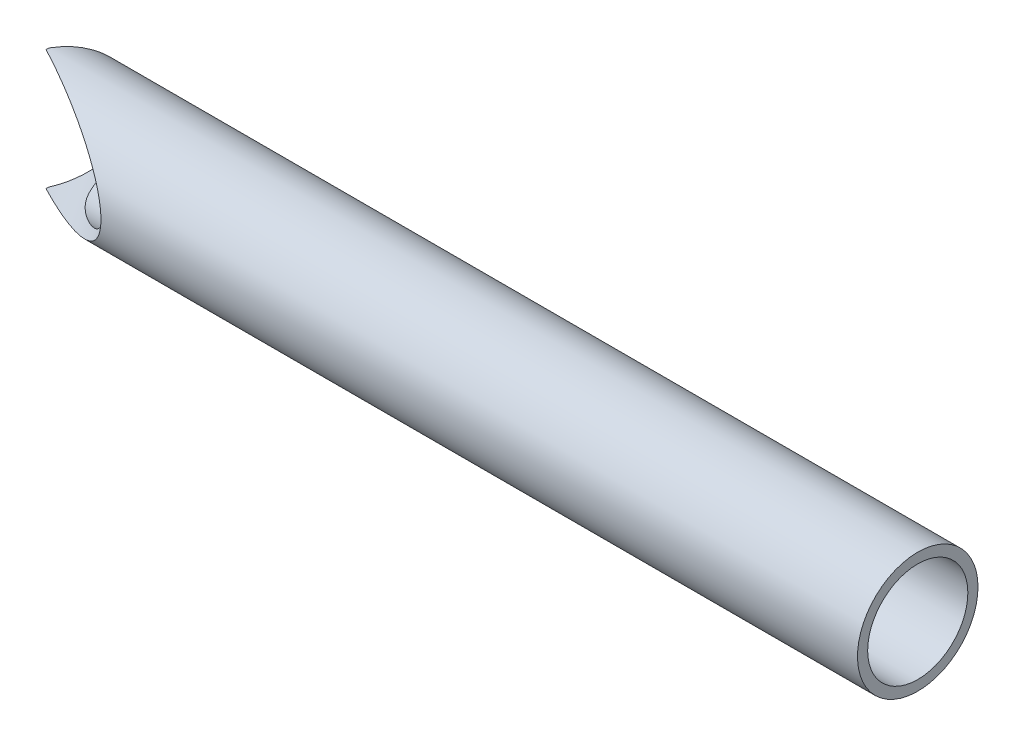
ISO-10303-21;
HEADER;
FILE_DESCRIPTION(('STEP AP214'),'2;1');
FILE_NAME('part.step','',(''),(''),'','','');
FILE_SCHEMA(('AUTOMOTIVE_DESIGN { 1 0 10303 214 1 1 1 1 }'));
ENDSEC;
DATA;
#1=APPLICATION_CONTEXT('core data for automotive mechanical design processes');
#2=APPLICATION_PROTOCOL_DEFINITION('international standard','automotive_design',2000,#1);
#3=PRODUCT_CONTEXT('',#1,'mechanical');
#4=PRODUCT('Part','Part','',(#3));
#5=PRODUCT_RELATED_PRODUCT_CATEGORY('part','',(#4));
#6=PRODUCT_DEFINITION_FORMATION('','',#4);
#7=PRODUCT_DEFINITION_CONTEXT('part definition',#1,'design');
#8=PRODUCT_DEFINITION('design','',#6,#7);
#9=PRODUCT_DEFINITION_SHAPE('','',#8);
#10=(LENGTH_UNIT() NAMED_UNIT(*) SI_UNIT(.MILLI.,.METRE.));
#11=(NAMED_UNIT(*) PLANE_ANGLE_UNIT() SI_UNIT($,.RADIAN.));
#12=(NAMED_UNIT(*) SI_UNIT($,.STERADIAN.) SOLID_ANGLE_UNIT());
#13=UNCERTAINTY_MEASURE_WITH_UNIT(LENGTH_MEASURE(1.E-05),#10,'distance_accuracy_value','');
#14=(GEOMETRIC_REPRESENTATION_CONTEXT(3) GLOBAL_UNCERTAINTY_ASSIGNED_CONTEXT((#13)) GLOBAL_UNIT_ASSIGNED_CONTEXT((#10,
#11,#12)) REPRESENTATION_CONTEXT('',''));
#15=CARTESIAN_POINT('',(0.,0.,0.));
#16=DIRECTION('',(0.,0.,1.));
#17=DIRECTION('',(1.,0.,0.));
#18=AXIS2_PLACEMENT_3D('',#15,#16,#17);
#19=CARTESIAN_POINT('',(304.8,0.,-1.11022302462516E-13));
#20=DIRECTION('',(1.,0.,0.));
#21=DIRECTION('',(0.,0.,-1.));
#22=AXIS2_PLACEMENT_3D('',#19,#20,#21);
#23=PLANE('',#22);
#24=CARTESIAN_POINT('',(304.8,0.,-1.11022302462516E-13));
#25=DIRECTION('',(1.,0.,0.));
#26=DIRECTION('',(0.,0.,-1.));
#27=AXIS2_PLACEMENT_3D('',#24,#25,#26);
#28=CIRCLE('',#27,21.082);
#29=CARTESIAN_POINT('',(304.8,0.,-21.0820000000001));
#30=VERTEX_POINT('',#29);
#31=EDGE_CURVE('E11',#30,#30,#28,.T.);
#32=ORIENTED_EDGE('',*,*,#31,.T.);
#33=EDGE_LOOP('',(#32));
#34=FACE_BOUND('',#33,.T.);
#35=CARTESIAN_POINT('',(304.8,0.,-1.11022302462516E-13));
#36=DIRECTION('',(1.,0.,0.));
#37=DIRECTION('',(0.,0.,-1.));
#38=AXIS2_PLACEMENT_3D('',#35,#36,#37);
#39=CIRCLE('',#38,17.526);
#40=CARTESIAN_POINT('',(304.8,0.,-17.5260000000001));
#41=VERTEX_POINT('',#40);
#42=EDGE_CURVE('E52',#41,#41,#39,.T.);
#43=ORIENTED_EDGE('',*,*,#42,.F.);
#44=EDGE_LOOP('',(#43));
#45=FACE_BOUND('',#44,.T.);
#46=ADVANCED_FACE('F40',(#34,#45),#23,.T.);
#47=CARTESIAN_POINT('',(304.8,0.,-1.11022302462516E-13));
#48=DIRECTION('',(-1.,0.,0.));
#49=DIRECTION('',(0.,0.,1.));
#50=AXIS2_PLACEMENT_3D('',#47,#48,#49);
#51=CYLINDRICAL_SURFACE('',#50,21.082);
#52=ORIENTED_EDGE('',*,*,#31,.F.);
#53=EDGE_LOOP('',(#52));
#54=FACE_BOUND('',#53,.T.);
#55=CARTESIAN_POINT('',(3.88578058618805E-13,0.,-1.11022302462516E-13));
#56=DIRECTION('',(1.,0.,0.));
#57=DIRECTION('',(0.,-0.999948117648207,0.0101863640131056));
#58=AXIS2_PLACEMENT_3D('',#55,#56,#57);
#59=CIRCLE('',#58,21.082);
#60=CARTESIAN_POINT('',(0.,-21.0809062162596,0.214748926124053));
#61=VERTEX_POINT('',#60);
#62=CARTESIAN_POINT('',(0.,-21.0671006615473,-0.792460545541385));
#63=VERTEX_POINT('',#62);
#64=EDGE_CURVE('E63',#61,#63,#59,.T.);
#65=ORIENTED_EDGE('',*,*,#64,.T.);
#66=CARTESIAN_POINT('',(-0.412528848871219,0.,-6.66133814775094E-13));
#67=DIRECTION('',(-0.887010833178221,0.,-0.461748613235035));
#68=DIRECTION('',(-0.461748613235035,0.,0.887010833178221));
#69=AXIS2_PLACEMENT_3D('',#66,#67,#68);
#70=ELLIPSE('',#69,23.7674662038362,21.082);
#71=CARTESIAN_POINT('',(0.,21.0671006615473,-0.792460545541385));
#72=VERTEX_POINT('',#71);
#73=EDGE_CURVE('E85',#63,#72,#70,.F.);
#74=ORIENTED_EDGE('',*,*,#73,.T.);
#75=CARTESIAN_POINT('',(3.88578058618805E-13,0.,-1.11022302462516E-13));
#76=DIRECTION('',(1.,0.,0.));
#77=DIRECTION('',(0.,0.999293267315585,-0.0375894386462891));
#78=AXIS2_PLACEMENT_3D('',#75,#76,#77);
#79=CIRCLE('',#78,21.082);
#80=CARTESIAN_POINT('',(0.,21.0809062162596,0.214748926124053));
#81=VERTEX_POINT('',#80);
#82=EDGE_CURVE('E71',#72,#81,#79,.T.);
#83=ORIENTED_EDGE('',*,*,#82,.T.);
#84=CARTESIAN_POINT('',(-0.412528848871219,0.,-6.66133814775094E-13));
#85=DIRECTION('',(-0.461748613235035,0.,0.887010833178221));
#86=DIRECTION('',(-0.887010833178221,0.,-0.461748613235035));
#87=AXIS2_PLACEMENT_3D('',#84,#85,#86);
#88=ELLIPSE('',#87,45.6568777809605,21.082);
#89=EDGE_CURVE('E79',#81,#61,#88,.F.);
#90=ORIENTED_EDGE('',*,*,#89,.T.);
#91=EDGE_LOOP('',(#65,#74,#83,#90));
#92=FACE_BOUND('',#91,.T.);
#93=ADVANCED_FACE('F42',(#54,#92),#51,.T.);
#94=CARTESIAN_POINT('',(304.8,0.,-1.11022302462516E-13));
#95=DIRECTION('',(-1.,0.,0.));
#96=DIRECTION('',(0.,0.,1.));
#97=AXIS2_PLACEMENT_3D('',#94,#95,#96);
#98=CYLINDRICAL_SURFACE('',#97,17.526);
#99=CARTESIAN_POINT('',(37.5956783460614,0.,17.5259999999997));
#100=CARTESIAN_POINT('',(37.5956757343342,-0.266591693921366,17.5259985254669));
#101=CARTESIAN_POINT('',(37.5852195806184,-0.533210368528521,17.5199024315982));
#102=CARTESIAN_POINT('',(37.5436769043272,-1.06428712664258,17.4956756124853));
#103=CARTESIAN_POINT('',(37.5125879680132,-1.32874495369672,17.4775434791977));
#104=CARTESIAN_POINT('',(37.4305715696158,-1.85371106065216,17.4296861124361));
#105=CARTESIAN_POINT('',(37.3796276924534,-2.11421588678214,17.3999512864077));
#106=CARTESIAN_POINT('',(37.2591517268877,-2.62940395903123,17.3295862109745));
#107=CARTESIAN_POINT('',(37.1896153738036,-2.88408585493862,17.2889534618334));
#108=CARTESIAN_POINT('',(37.0150763552254,-3.44546735012382,17.186879440517));
#109=CARTESIAN_POINT('',(36.9055779186927,-3.75029344773679,17.1227912894422));
#110=CARTESIAN_POINT('',(36.6636867105998,-4.34735917200366,16.981031459871));
#111=CARTESIAN_POINT('',(36.5312881321429,-4.63959558269722,16.9033563360054));
#112=CARTESIAN_POINT('',(36.1040445889777,-5.4968905859841,16.6523151825902));
#113=CARTESIAN_POINT('',(35.7793158505715,-6.0420357616058,16.4610289865015));
#114=CARTESIAN_POINT('',(35.1484677628083,-6.96670284677443,16.0878480383628));
#115=CARTESIAN_POINT('',(34.8532048965475,-7.35672085388379,15.91268416022));
#116=CARTESIAN_POINT('',(34.2350752115212,-8.10560937801357,15.5445733115743));
#117=CARTESIAN_POINT('',(33.9121916783198,-8.46446076631484,15.3516155676615));
#118=CARTESIAN_POINT('',(33.2447171596937,-9.15363558856362,14.9509484423164));
#119=CARTESIAN_POINT('',(32.9000894741168,-9.48390843229503,14.7432140410215));
#120=CARTESIAN_POINT('',(32.1942280749967,-10.1179099352186,14.3155440312093));
#121=CARTESIAN_POINT('',(31.8329883035228,-10.4216287919351,14.0956039655078));
#122=CARTESIAN_POINT('',(31.1256292114688,-10.982526906228,13.6623788783866));
#123=CARTESIAN_POINT('',(30.7804465328531,-11.2414888863027,13.4498579597254));
#124=CARTESIAN_POINT('',(30.0814528778671,-11.7401811112135,13.0168295574418));
#125=CARTESIAN_POINT('',(29.7276432542762,-11.9799143463133,12.796323323388));
#126=CARTESIAN_POINT('',(29.0128897012653,-12.4418004773528,12.3477127317297));
#127=CARTESIAN_POINT('',(28.6519396593035,-12.663937417077,12.1196017385253));
#128=CARTESIAN_POINT('',(27.9247645702659,-13.0916008440151,11.6563304804557));
#129=CARTESIAN_POINT('',(27.5585393416381,-13.2971267579232,11.4211699726703));
#130=CARTESIAN_POINT('',(26.821375562095,-13.6930015234821,10.9434377772123));
#131=CARTESIAN_POINT('',(26.4504284150518,-13.8833159942265,10.7008509244595));
#132=CARTESIAN_POINT('',(25.7058508428144,-14.2490951262902,10.2087198159034));
#133=CARTESIAN_POINT('',(25.3322204254746,-14.4245598310583,9.95917558045949));
#134=CARTESIAN_POINT('',(24.5836334089568,-14.7612126203226,9.45302136990812));
#135=CARTESIAN_POINT('',(24.2086775602099,-14.9224077488864,9.19641496392709));
#136=CARTESIAN_POINT('',(23.4584259946178,-15.2311010777694,8.67559134317339));
#137=CARTESIAN_POINT('',(23.083130287422,-15.3785996553676,8.41137433830159));
#138=CARTESIAN_POINT('',(22.4198497942577,-15.6277404739815,7.93654518426499));
#139=CARTESIAN_POINT('',(22.1316819550169,-15.7321153030365,7.72761706802599));
#140=CARTESIAN_POINT('',(21.5564880179457,-15.9329906700675,7.3044741940868));
#141=CARTESIAN_POINT('',(21.2694618979442,-16.029491361669,7.09025953963391));
#142=CARTESIAN_POINT('',(20.6971292390352,-16.2146350747561,6.65597683210696));
#143=CARTESIAN_POINT('',(20.4118233651604,-16.3032752188436,6.43590667360188));
#144=CARTESIAN_POINT('',(19.8438444104349,-16.4725425248561,5.98940922713016));
#145=CARTESIAN_POINT('',(19.5611711536262,-16.5531702258484,5.76298236815083));
#146=CARTESIAN_POINT('',(19.0001941144989,-16.7059747611284,5.30372351987854));
#147=CARTESIAN_POINT('',(18.7218799280404,-16.7781757475843,5.07091232223927));
#148=CARTESIAN_POINT('',(18.1698685960631,-16.9140531496684,4.59740790092257));
#149=CARTESIAN_POINT('',(17.8961716931655,-16.9777291185504,4.35671426499469));
#150=CARTESIAN_POINT('',(17.3549460163737,-17.0959968006572,3.86666131930177));
#151=CARTESIAN_POINT('',(17.0874132651965,-17.1505945213461,3.61730787325212));
#152=CARTESIAN_POINT('',(16.5600485107867,-17.2500269948893,3.10875660024493));
#153=CARTESIAN_POINT('',(16.3002151819178,-17.2948634369138,2.84956048567374));
#154=CARTESIAN_POINT('',(15.7866388580657,-17.3743736027317,2.31635879089339));
#155=CARTESIAN_POINT('',(15.5330356712516,-17.4088931841124,2.04219466678285));
#156=CARTESIAN_POINT('',(15.0385209099801,-17.4655588493314,1.4813404005012));
#157=CARTESIAN_POINT('',(14.7976093452937,-17.4877049236437,1.19465024868688));
#158=CARTESIAN_POINT('',(14.3320609894755,-17.5179015985779,0.608185347775268));
#159=CARTESIAN_POINT('',(14.107402267984,-17.5259715458154,0.308429139148951));
#160=CARTESIAN_POINT('',(13.6778075547061,-17.5260282825475,-0.304956753795662));
#161=CARTESIAN_POINT('',(13.4728676227163,-17.5180182921543,-0.61858364811869));
#162=CARTESIAN_POINT('',(13.1171103065544,-17.4863488686435,-1.20885680149257));
#163=CARTESIAN_POINT('',(12.9628494709119,-17.465347769395,-1.48356510155695));
#164=CARTESIAN_POINT('',(12.6735025828289,-17.4089497727558,-2.04149872177959));
#165=CARTESIAN_POINT('',(12.5384143994389,-17.3735544769048,-2.32472309116995));
#166=CARTESIAN_POINT('',(12.289374688493,-17.2872171159725,-2.89769174726171));
#167=CARTESIAN_POINT('',(12.175401352853,-17.2362912368986,-3.18742895643231));
#168=CARTESIAN_POINT('',(11.9694540243186,-17.1180108253338,-3.77135210278651));
#169=CARTESIAN_POINT('',(11.8774802782599,-17.0506561085281,-4.06553808984612));
#170=CARTESIAN_POINT('',(11.7155617426973,-16.8990863040413,-4.65556815442476));
#171=CARTESIAN_POINT('',(11.6456142051966,-16.8148733217489,-4.95141202041519));
#172=CARTESIAN_POINT('',(11.5267241499273,-16.6295723661745,-5.54200289702484));
#173=CARTESIAN_POINT('',(11.4777819747979,-16.5284841176609,-5.83674988967414));
#174=CARTESIAN_POINT('',(11.3990138978571,-16.3095816124055,-6.42310913947894));
#175=CARTESIAN_POINT('',(11.3692209470817,-16.1917389486219,-6.71471514877025));
#176=CARTESIAN_POINT('',(11.3265474260182,-15.9400030227592,-7.2922067801259));
#177=CARTESIAN_POINT('',(11.3136714016832,-15.8061054569163,-7.57809084426088));
#178=CARTESIAN_POINT('',(11.3002739925266,-15.4720489518085,-8.24381057772075));
#179=CARTESIAN_POINT('',(11.3058518113479,-15.2653651409013,-8.62050709693376));
#180=CARTESIAN_POINT('',(11.3374036085675,-14.8253087575275,-9.35709142082312));
#181=CARTESIAN_POINT('',(11.363384815199,-14.591926751827,-9.7169732207303));
#182=CARTESIAN_POINT('',(11.4302444398313,-14.0999191105803,-10.4180878718908));
#183=CARTESIAN_POINT('',(11.4711383313585,-13.8412674598608,-10.7593009278447));
#184=CARTESIAN_POINT('',(11.5630973693106,-13.30049965019,-11.4210323009506));
#185=CARTESIAN_POINT('',(11.6141616166598,-13.0183855666383,-11.7415524440748));
#186=CARTESIAN_POINT('',(11.723877305285,-12.4248415416481,-12.3683005242646));
#187=CARTESIAN_POINT('',(11.7826856550682,-12.1128576157135,-12.6739759695464));
#188=CARTESIAN_POINT('',(11.9033499851492,-11.4672898100729,-13.260930071901));
#189=CARTESIAN_POINT('',(11.9652059913159,-11.1337057470154,-13.5422085218338));
#190=CARTESIAN_POINT('',(12.089037382753,-10.4466238966316,-14.0790165868124));
#191=CARTESIAN_POINT('',(12.1510127216911,-10.0931327424196,-14.3345547004104));
#192=CARTESIAN_POINT('',(12.2726813712795,-9.36779500958398,-14.8187469142335));
#193=CARTESIAN_POINT('',(12.3323745249596,-8.99594717239198,-15.0473991674692));
#194=CARTESIAN_POINT('',(12.4554216496206,-8.18296116687626,-15.5063479163149));
#195=CARTESIAN_POINT('',(12.5181358309654,-7.7393637885716,-15.7324776236799));
#196=CARTESIAN_POINT('',(12.635481538374,-6.83360646084131,-16.1465318043693));
#197=CARTESIAN_POINT('',(12.6901123379519,-6.3714448477141,-16.3344528442956));
#198=CARTESIAN_POINT('',(12.7893120080732,-5.43172609184849,-16.670514354985));
#199=CARTESIAN_POINT('',(12.8338792630252,-4.95416649117594,-16.8186484391125));
#200=CARTESIAN_POINT('',(12.9114042341611,-3.98726114515002,-17.0737338292837));
#201=CARTESIAN_POINT('',(12.9443625827491,-3.49791604337294,-17.1806873786984));
#202=CARTESIAN_POINT('',(12.9967317603521,-2.52692426099745,-17.3496508360554));
#203=CARTESIAN_POINT('',(13.0165408009014,-2.04552910981843,-17.412984224909));
#204=CARTESIAN_POINT('',(13.0436537689205,-1.0787921600856,-17.4994966465916));
#205=CARTESIAN_POINT('',(13.0509578831511,-0.593450420582789,-17.5226762791164));
#206=CARTESIAN_POINT('',(13.0528400761785,0.377417221037651,-17.5286579845347));
#207=CARTESIAN_POINT('',(13.0474204439988,0.862943074321155,-17.5114673201131));
#208=CARTESIAN_POINT('',(13.0240232879626,1.83058574634327,-17.4368889572927));
#209=CARTESIAN_POINT('',(13.0060459512341,2.31270261577257,-17.3795018578792));
#210=CARTESIAN_POINT('',(12.9587974572564,3.25565691933255,-17.2273801641892));
#211=CARTESIAN_POINT('',(12.9298786834465,3.71670042411045,-17.1338090355951));
#212=CARTESIAN_POINT('',(12.8615824654994,4.62903445038871,-16.9101539153409));
#213=CARTESIAN_POINT('',(12.8222052772019,5.08032521017438,-16.7800708168533));
#214=CARTESIAN_POINT('',(12.7341823149961,5.97012105047333,-16.484480006277));
#215=CARTESIAN_POINT('',(12.6855381575885,6.40862834553443,-16.3189784718481));
#216=CARTESIAN_POINT('',(12.5805065901408,7.27020881934784,-15.9537982574262));
#217=CARTESIAN_POINT('',(12.5241189866222,7.69328161211793,-15.754118723428));
#218=CARTESIAN_POINT('',(12.4040980127461,8.53126141210142,-15.3168810898396));
#219=CARTESIAN_POINT('',(12.3403250107231,8.94573984374935,-15.0785400386636));
#220=CARTESIAN_POINT('',(12.209137465655,9.75344849428375,-14.5691084262682));
#221=CARTESIAN_POINT('',(12.1417228332117,10.1466781910625,-14.2980170608621));
#222=CARTESIAN_POINT('',(12.0061531026761,10.9102955982285,-13.7242340889998));
#223=CARTESIAN_POINT('',(11.9379969426669,11.2806434375339,-13.4214896683306));
#224=CARTESIAN_POINT('',(11.8047484196985,11.9956707208194,-12.7864462138049));
#225=CARTESIAN_POINT('',(11.7396560708181,12.340350046851,-12.4541470441576));
#226=CARTESIAN_POINT('',(11.6143922419065,13.0163651030946,-11.7466820830764));
#227=CARTESIAN_POINT('',(11.5545562400255,13.3464753324508,-11.3702827066671));
#228=CARTESIAN_POINT('',(11.449477726415,13.9742832041842,-10.589199458683));
#229=CARTESIAN_POINT('',(11.404238970734,14.2719724912267,-10.1845083398392));
#230=CARTESIAN_POINT('',(11.3363402982302,14.8314770762995,-9.35089361299598));
#231=CARTESIAN_POINT('',(11.3136135711169,15.0933965237695,-8.92204572455856));
#232=CARTESIAN_POINT('',(11.2998781075408,15.5795110126255,-8.04307874017645));
#233=CARTESIAN_POINT('',(11.3088436421262,15.8037365004987,-7.59297719153325));
#234=CARTESIAN_POINT('',(11.3575118380126,16.1361570592038,-6.84724835979179));
#235=CARTESIAN_POINT('',(11.3845941460805,16.2565598366814,-6.55618132229623));
#236=CARTESIAN_POINT('',(11.4577022989314,16.4808144307685,-5.97007231241614));
#237=CARTESIAN_POINT('',(11.5037240446164,16.584669822017,-5.67503121350218));
#238=CARTESIAN_POINT('',(11.6165416869377,16.7752836136702,-5.08397482880348));
#239=CARTESIAN_POINT('',(11.683300311057,16.8620722364624,-4.7879622262736));
#240=CARTESIAN_POINT('',(11.8387675203287,17.0187408063841,-4.19720396925863));
#241=CARTESIAN_POINT('',(11.9274764608599,17.0886204797189,-3.90245833536454));
#242=CARTESIAN_POINT('',(12.1270562745918,17.2118865987532,-3.31681574445057));
#243=CARTESIAN_POINT('',(12.2379428344996,17.2652613017055,-3.02592166788568));
#244=CARTESIAN_POINT('',(12.4809373622406,17.356263217038,-2.45064148916974));
#245=CARTESIAN_POINT('',(12.6130454533583,17.3938903379297,-2.16625542483728));
#246=CARTESIAN_POINT('',(12.8969238321857,17.4545951474949,-1.60545023699927));
#247=CARTESIAN_POINT('',(13.0487193832945,17.4776539145677,-1.32904191769746));
#248=CARTESIAN_POINT('',(13.3695753815121,17.51049773706,-0.78565617239405));
#249=CARTESIAN_POINT('',(13.5386381338951,17.5202810176256,-0.518680012062367));
#250=CARTESIAN_POINT('',(13.9929463125557,17.5301658092918,0.155881845784542));
#251=CARTESIAN_POINT('',(14.2891781242162,17.5214865346058,0.556214434911194));
#252=CARTESIAN_POINT('',(14.9094987408837,17.4795481063974,1.33330357089925));
#253=CARTESIAN_POINT('',(15.233606785757,17.4462718540506,1.71004351939387));
#254=CARTESIAN_POINT('',(15.903599957077,17.3587413655962,2.44372112066117));
#255=CARTESIAN_POINT('',(16.2495691656003,17.3044014145171,2.80057095840053));
#256=CARTESIAN_POINT('',(16.9563451504198,17.177499519199,3.4955557887758));
#257=CARTESIAN_POINT('',(17.3171493308719,17.1049407516622,3.83369403150589));
#258=CARTESIAN_POINT('',(18.074145922457,16.9379861627252,4.51629738235474));
#259=CARTESIAN_POINT('',(18.471083609647,16.8424473746218,4.85965034283082));
#260=CARTESIAN_POINT('',(19.2733884584434,16.6340643923991,5.53101200162108));
#261=CARTESIAN_POINT('',(19.6787575192409,16.5212162619974,5.85901718753105));
#262=CARTESIAN_POINT('',(20.4953711895783,16.2788518025198,6.50214129508176));
#263=CARTESIAN_POINT('',(20.9066213653711,16.1493186057658,6.81724674506366));
#264=CARTESIAN_POINT('',(21.7322759971374,15.8739601481862,7.43590455048023));
#265=CARTESIAN_POINT('',(22.1466802307201,15.7281360262871,7.73945771156844));
#266=CARTESIAN_POINT('',(22.9765558974475,15.4201779475868,8.33615240530492));
#267=CARTESIAN_POINT('',(23.3920266585968,15.2580525661829,8.62929930355604));
#268=CARTESIAN_POINT('',(24.2225720431433,14.9170369530587,9.20624600649722));
#269=CARTESIAN_POINT('',(24.6376466707264,14.7381469005152,9.49004591104191));
#270=CARTESIAN_POINT('',(25.4654583709686,14.3631035909842,10.0486317289701));
#271=CARTESIAN_POINT('',(25.8781971935922,14.1669658214909,10.3234254310751));
#272=CARTESIAN_POINT('',(26.7001561774995,13.7563529562482,10.864565800658));
#273=CARTESIAN_POINT('',(27.1093759848904,13.5418760394025,11.1309116256443));
#274=CARTESIAN_POINT('',(27.9786333983786,13.0624984133785,11.6912758648435));
#275=CARTESIAN_POINT('',(28.4378983488399,12.7947226386884,11.9840464662665));
#276=CARTESIAN_POINT('',(29.3466531513817,12.2318070410288,12.5580707245201));
#277=CARTESIAN_POINT('',(29.7961450903892,11.9366731323874,12.8393268517037));
#278=CARTESIAN_POINT('',(30.6815313196358,11.316588041932,13.3890651852282));
#279=CARTESIAN_POINT('',(31.1174374886919,10.991663946639,13.6575586650973));
#280=CARTESIAN_POINT('',(31.9714922286977,10.308622724273,14.1801943290088));
#281=CARTESIAN_POINT('',(32.3896459339594,9.95051529106554,14.4343406695945));
#282=CARTESIAN_POINT('',(33.0909724684634,9.30047282100156,14.8582760382518));
#283=CARTESIAN_POINT('',(33.3797668693346,9.01725019599009,15.0321162426082));
#284=CARTESIAN_POINT('',(33.9418468264398,8.42974785505879,15.369281143416));
#285=CARTESIAN_POINT('',(34.2151309368553,8.1254661819321,15.5326048597452));
#286=CARTESIAN_POINT('',(34.7420393485891,7.49474932244908,15.8465533830212));
#287=CARTESIAN_POINT('',(34.9956883870385,7.16834301570791,15.9971941901468));
#288=CARTESIAN_POINT('',(35.4787823312822,6.49211050864951,16.2833682797996));
#289=CARTESIAN_POINT('',(35.708238799297,6.14229562773736,16.4189087809032));
#290=CARTESIAN_POINT('',(36.2118785474258,5.29239287732205,16.7157850676371));
#291=CARTESIAN_POINT('',(36.4740047590975,4.78223969541902,16.8697821348234));
#292=CARTESIAN_POINT('',(36.8132645979151,3.98678280058907,17.0687141414746));
#293=CARTESIAN_POINT('',(36.9173256065307,3.71673072144591,17.1296591145103));
#294=CARTESIAN_POINT('',(37.1053606543379,3.16731859501964,17.2396959722182));
#295=CARTESIAN_POINT('',(37.1893398051233,2.88796093702899,17.2887908732128));
#296=CARTESIAN_POINT('',(37.3164844256438,2.39370757037564,17.3630772272715));
#297=CARTESIAN_POINT('',(37.3645974720794,2.18050655970892,17.3911721319426));
#298=CARTESIAN_POINT('',(37.4476947578886,1.75070959465793,17.4396797605552));
#299=CARTESIAN_POINT('',(37.4826811647896,1.53411420692665,17.4600937528035));
#300=CARTESIAN_POINT('',(37.5389211973868,1.09851929790022,17.4929024683177));
#301=CARTESIAN_POINT('',(37.5601737212688,0.879519585148737,17.5052965481784));
#302=CARTESIAN_POINT('',(37.5885517079343,0.440352524797704,17.5218449511073));
#303=CARTESIAN_POINT('',(37.5956805031592,0.220185464924857,17.5260012178572));
#304=CARTESIAN_POINT('',(37.5956783460614,0.,17.5259999999997));
#305=B_SPLINE_CURVE_WITH_KNOTS('',3,(#99,#100,#101,#102,#103,#104,#105,#106,#107,#108,#109,#110,
#111,#112,#113,#114,#115,#116,#117,#118,#119,#120,#121,#122,#123,#124,#125,#126,#127,#128,#129,
#130,#131,#132,#133,#134,#135,#136,#137,#138,#139,#140,#141,#142,#143,#144,#145,#146,#147,#148,
#149,#150,#151,#152,#153,#154,#155,#156,#157,#158,#159,#160,#161,#162,#163,#164,#165,#166,#167,
#168,#169,#170,#171,#172,#173,#174,#175,#176,#177,#178,#179,#180,#181,#182,#183,#184,#185,#186,
#187,#188,#189,#190,#191,#192,#193,#194,#195,#196,#197,#198,#199,#200,#201,#202,#203,#204,#205,
#206,#207,#208,#209,#210,#211,#212,#213,#214,#215,#216,#217,#218,#219,#220,#221,#222,#223,#224,
#225,#226,#227,#228,#229,#230,#231,#232,#233,#234,#235,#236,#237,#238,#239,#240,#241,#242,#243,
#244,#245,#246,#247,#248,#249,#250,#251,#252,#253,#254,#255,#256,#257,#258,#259,#260,#261,#262,
#263,#264,#265,#266,#267,#268,#269,#270,#271,#272,#273,#274,#275,#276,#277,#278,#279,#280,#281,
#282,#283,#284,#285,#286,#287,#288,#289,#290,#291,#292,#293,#294,#295,#296,#297,#298,#299,#300,
#301,#302,#303,#304),.UNSPECIFIED.,.T.,.F.,(4,2,2,2,2,2,2,2,2,2,2,2,2,2,2,2,2,2,2,2,2,2,2,2,2,2,
2,2,2,2,2,2,2,2,2,2,2,2,2,2,2,2,2,2,2,2,2,2,2,2,2,2,2,2,2,2,2,2,2,2,2,2,2,2,2,2,2,2,2,2,2,2,2,2,
2,2,2,2,2,2,2,2,2,2,2,2,2,2,2,2,2,2,2,2,2,2,2,2,2,2,2,2,4),(0.,0.79955087643319,
1.59919530530718,2.39950224768414,3.19999291954056,4.18898676247546,5.17823175788323,
7.15830390467635,8.71517370786121,10.2729923954271,11.8335146305073,13.3946105254252,
14.8370915704042,16.27934785837,17.7228973505047,19.1664966434211,20.6132715517281,
22.0600422267772,23.5060946848395,24.9521072987862,26.0647708277064,27.1774126432257,
28.290460080713,29.4034325829683,30.5131324530138,31.6228904531903,32.731911131023,
33.840739742174,34.9653903926484,36.0900419089549,37.2131464517328,38.3360261079532,
39.2823705484477,40.2286097247306,41.1738660793116,42.1191330391891,43.0642820204915,
44.0094464184648,44.9562328848505,45.9032737217397,47.1904956918303,48.4781738871519,
49.7671920076116,51.0560962273561,52.3770042109122,53.6979234083944,55.0184050454852,
56.3389773433335,57.8426297153766,59.34641714468,60.8504458191391,62.3543925478023,
63.8104179830223,65.2664216723379,66.7221634441883,68.1778835238315,69.5902392746402,
71.002560478767,72.4146355472543,73.8267459043939,75.2721935283352,76.7176766525803,
78.165611315058,79.61355263049,81.1242396507248,82.6353150796384,84.1418924422506,
85.6472469905686,86.5948053957449,87.54215882685,88.4878192403258,89.4334949651832,
90.379841967589,91.3261944679008,92.2737735920757,93.2214793894835,94.7131725728188,
96.2059036973172,97.7047740969608,99.2033833291222,100.803094118047,102.403169234783,
104.004874824258,105.606468505748,107.207224021926,108.807962431562,110.407277864421,
112.006752295815,113.826756567519,115.64636830112,117.464341669672,119.281785617041,
120.601832055383,121.922001342696,123.240479398147,124.558324436794,126.33287021968,
127.219285061168,128.10547403575,128.766057266423,129.426531370685,130.087058455553,
130.747429672934),.UNSPECIFIED.);
#306=CARTESIAN_POINT('',(37.5956783460614,0.,17.5259999999997));
#307=VERTEX_POINT('',#306);
#308=EDGE_CURVE('E83',#307,#307,#305,.T.);
#309=ORIENTED_EDGE('',*,*,#308,.F.);
#310=EDGE_LOOP('',(#309));
#311=FACE_BOUND('',#310,.T.);
#312=ORIENTED_EDGE('',*,*,#42,.T.);
#313=EDGE_LOOP('',(#312));
#314=FACE_BOUND('',#313,.T.);
#315=ADVANCED_FACE('F105',(#311,#314),#98,.F.);
#316=CARTESIAN_POINT('',(157.836598427826,0.,226.003175688896));
#317=DIRECTION('',(-0.573576436351044,0.,-0.819152044288993));
#318=DIRECTION('',(-0.819152044288993,0.,0.573576436351044));
#319=AXIS2_PLACEMENT_3D('',#316,#317,#318);
#320=CYLINDRICAL_SURFACE('',#319,21.082);
#321=ORIENTED_EDGE('',*,*,#308,.T.);
#322=EDGE_LOOP('',(#321));
#323=FACE_BOUND('',#322,.T.);
#324=ORIENTED_EDGE('',*,*,#64,.F.);
#325=ORIENTED_EDGE('',*,*,#89,.F.);
#326=ORIENTED_EDGE('',*,*,#82,.F.);
#327=ORIENTED_EDGE('',*,*,#73,.F.);
#328=EDGE_LOOP('',(#324,#325,#326,#327));
#329=FACE_BOUND('',#328,.T.);
#330=ADVANCED_FACE('F80',(#323,#329),#320,.F.);
#331=CLOSED_SHELL('',(#46,#93,#315,#330));
#332=MANIFOLD_SOLID_BREP('B2',#331);
#333=ADVANCED_BREP_SHAPE_REPRESENTATION('',(#18,#332),#14);
#334=SHAPE_DEFINITION_REPRESENTATION(#9,#333);
ENDSEC;
END-ISO-10303-21;
